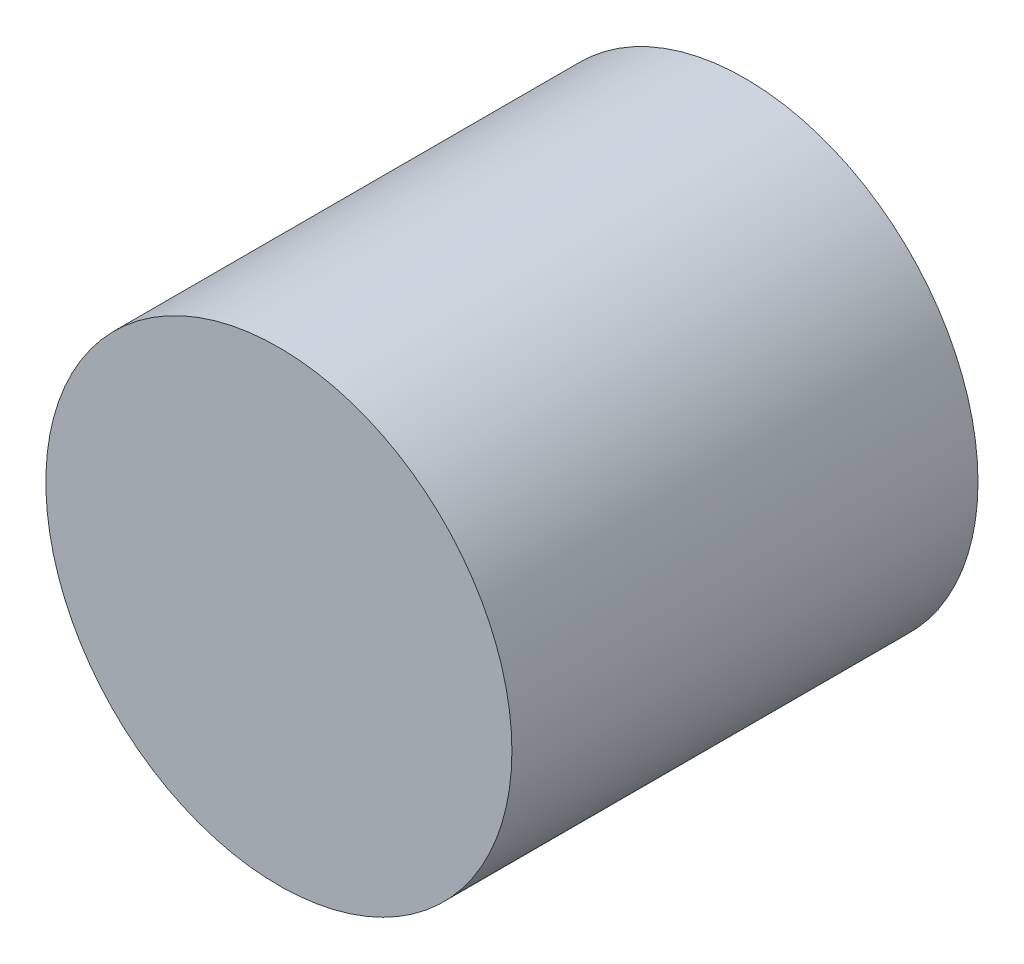
ISO-10303-21;
HEADER;
FILE_DESCRIPTION(('STEP AP214'),'2;1');
FILE_NAME('part.step','',(''),(''),'','','');
FILE_SCHEMA(('AUTOMOTIVE_DESIGN { 1 0 10303 214 1 1 1 1 }'));
ENDSEC;
DATA;
#1=APPLICATION_CONTEXT('core data for automotive mechanical design processes');
#2=APPLICATION_PROTOCOL_DEFINITION('international standard','automotive_design',2000,#1);
#3=PRODUCT_CONTEXT('',#1,'mechanical');
#4=PRODUCT('Part','Part','',(#3));
#5=PRODUCT_RELATED_PRODUCT_CATEGORY('part','',(#4));
#6=PRODUCT_DEFINITION_FORMATION('','',#4);
#7=PRODUCT_DEFINITION_CONTEXT('part definition',#1,'design');
#8=PRODUCT_DEFINITION('design','',#6,#7);
#9=PRODUCT_DEFINITION_SHAPE('','',#8);
#10=(LENGTH_UNIT() NAMED_UNIT(*) SI_UNIT(.MILLI.,.METRE.));
#11=(NAMED_UNIT(*) PLANE_ANGLE_UNIT() SI_UNIT($,.RADIAN.));
#12=(NAMED_UNIT(*) SI_UNIT($,.STERADIAN.) SOLID_ANGLE_UNIT());
#13=UNCERTAINTY_MEASURE_WITH_UNIT(LENGTH_MEASURE(1.E-05),#10,'distance_accuracy_value','');
#14=(GEOMETRIC_REPRESENTATION_CONTEXT(3) GLOBAL_UNCERTAINTY_ASSIGNED_CONTEXT((#13)) GLOBAL_UNIT_ASSIGNED_CONTEXT((#10,
#11,#12)) REPRESENTATION_CONTEXT('',''));
#15=CARTESIAN_POINT('',(0.,0.,0.));
#16=DIRECTION('',(0.,0.,1.));
#17=DIRECTION('',(1.,0.,0.));
#18=AXIS2_PLACEMENT_3D('',#15,#16,#17);
#19=CARTESIAN_POINT('',(0.,0.,3.));
#20=DIRECTION('',(0.,0.,-1.));
#21=DIRECTION('',(-1.,0.,0.));
#22=AXIS2_PLACEMENT_3D('',#19,#20,#21);
#23=CYLINDRICAL_SURFACE('',#22,1.5);
#24=CARTESIAN_POINT('',(0.,0.,3.));
#25=DIRECTION('',(0.,0.,1.));
#26=DIRECTION('',(1.,0.,0.));
#27=AXIS2_PLACEMENT_3D('',#24,#25,#26);
#28=CIRCLE('',#27,1.5);
#29=CARTESIAN_POINT('',(1.5,0.,3.));
#30=VERTEX_POINT('',#29);
#31=EDGE_CURVE('E10',#30,#30,#28,.T.);
#32=ORIENTED_EDGE('',*,*,#31,.F.);
#33=EDGE_LOOP('',(#32));
#34=FACE_BOUND('',#33,.T.);
#35=CARTESIAN_POINT('',(0.,0.,0.));
#36=DIRECTION('',(0.,0.,1.));
#37=DIRECTION('',(1.,0.,0.));
#38=AXIS2_PLACEMENT_3D('',#35,#36,#37);
#39=CIRCLE('',#38,1.5);
#40=CARTESIAN_POINT('',(1.5,0.,0.));
#41=VERTEX_POINT('',#40);
#42=EDGE_CURVE('E40',#41,#41,#39,.T.);
#43=ORIENTED_EDGE('',*,*,#42,.T.);
#44=EDGE_LOOP('',(#43));
#45=FACE_BOUND('',#44,.T.);
#46=ADVANCED_FACE('F37',(#34,#45),#23,.T.);
#47=CARTESIAN_POINT('',(0.,0.,3.));
#48=DIRECTION('',(0.,0.,1.));
#49=DIRECTION('',(1.,0.,0.));
#50=AXIS2_PLACEMENT_3D('',#47,#48,#49);
#51=PLANE('',#50);
#52=ORIENTED_EDGE('',*,*,#31,.T.);
#53=EDGE_LOOP('',(#52));
#54=FACE_BOUND('',#53,.T.);
#55=ADVANCED_FACE('F54',(#54),#51,.T.);
#56=CARTESIAN_POINT('',(0.,0.,0.));
#57=DIRECTION('',(0.,0.,1.));
#58=DIRECTION('',(1.,0.,0.));
#59=AXIS2_PLACEMENT_3D('',#56,#57,#58);
#60=PLANE('',#59);
#61=ORIENTED_EDGE('',*,*,#42,.F.);
#62=EDGE_LOOP('',(#61));
#63=FACE_BOUND('',#62,.T.);
#64=ADVANCED_FACE('F52',(#63),#60,.F.);
#65=CLOSED_SHELL('',(#46,#55,#64));
#66=MANIFOLD_SOLID_BREP('B2',#65);
#67=ADVANCED_BREP_SHAPE_REPRESENTATION('',(#18,#66),#14);
#68=SHAPE_DEFINITION_REPRESENTATION(#9,#67);
ENDSEC;
END-ISO-10303-21;
